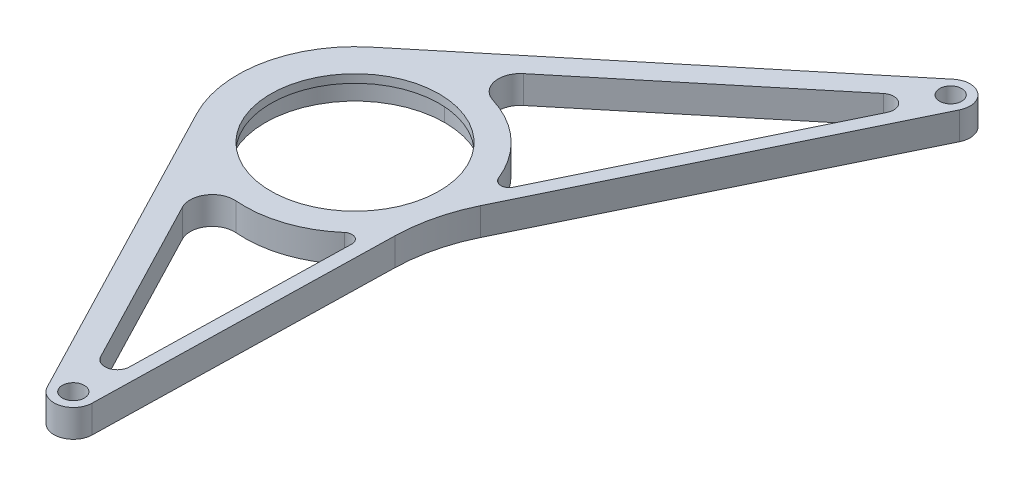
ISO-10303-21;
HEADER;
FILE_DESCRIPTION(('STEP AP214'),'2;1');
FILE_NAME('part.step','',(''),(''),'','','');
FILE_SCHEMA(('AUTOMOTIVE_DESIGN { 1 0 10303 214 1 1 1 1 }'));
ENDSEC;
DATA;
#1=APPLICATION_CONTEXT('core data for automotive mechanical design processes');
#2=APPLICATION_PROTOCOL_DEFINITION('international standard','automotive_design',2000,#1);
#3=PRODUCT_CONTEXT('',#1,'mechanical');
#4=PRODUCT('Part','Part','',(#3));
#5=PRODUCT_RELATED_PRODUCT_CATEGORY('part','',(#4));
#6=PRODUCT_DEFINITION_FORMATION('','',#4);
#7=PRODUCT_DEFINITION_CONTEXT('part definition',#1,'design');
#8=PRODUCT_DEFINITION('design','',#6,#7);
#9=PRODUCT_DEFINITION_SHAPE('','',#8);
#10=(LENGTH_UNIT() NAMED_UNIT(*) SI_UNIT(.MILLI.,.METRE.));
#11=(NAMED_UNIT(*) PLANE_ANGLE_UNIT() SI_UNIT($,.RADIAN.));
#12=(NAMED_UNIT(*) SI_UNIT($,.STERADIAN.) SOLID_ANGLE_UNIT());
#13=UNCERTAINTY_MEASURE_WITH_UNIT(LENGTH_MEASURE(1.E-05),#10,'distance_accuracy_value','');
#14=(GEOMETRIC_REPRESENTATION_CONTEXT(3) GLOBAL_UNCERTAINTY_ASSIGNED_CONTEXT((#13)) GLOBAL_UNIT_ASSIGNED_CONTEXT((#10,
#11,#12)) REPRESENTATION_CONTEXT('',''));
#15=CARTESIAN_POINT('',(0.,0.,0.));
#16=DIRECTION('',(0.,0.,1.));
#17=DIRECTION('',(1.,0.,0.));
#18=AXIS2_PLACEMENT_3D('',#15,#16,#17);
#19=CARTESIAN_POINT('',(1581.69995966024,10.,273.085544755227));
#20=DIRECTION('',(0.,-1.,0.));
#21=DIRECTION('',(0.,0.,-1.));
#22=AXIS2_PLACEMENT_3D('',#19,#20,#21);
#23=CYLINDRICAL_SURFACE('',#22,32.5);
#24=CARTESIAN_POINT('',(1581.69995966024,7.,273.085544755227));
#25=DIRECTION('',(0.,-1.,0.));
#26=DIRECTION('',(0.,0.,-1.));
#27=AXIS2_PLACEMENT_3D('',#24,#25,#26);
#28=CIRCLE('',#27,32.5);
#29=CARTESIAN_POINT('',(1581.69995966024,7.,305.585544755227));
#30=VERTEX_POINT('',#29);
#31=CARTESIAN_POINT('',(1581.69995966024,7.,240.585544755227));
#32=VERTEX_POINT('',#31);
#33=EDGE_CURVE('E325',#30,#32,#28,.T.);
#34=ORIENTED_EDGE('',*,*,#33,.F.);
#35=DIRECTION('',(0.,-1.,0.));
#36=VECTOR('',#35,1.);
#37=CARTESIAN_POINT('',(1581.69995966024,10.,305.585544755227));
#38=LINE('',#37,#36);
#39=CARTESIAN_POINT('',(1581.69995966024,0.,305.585544755227));
#40=VERTEX_POINT('',#39);
#41=EDGE_CURVE('E333',#30,#40,#38,.T.);
#42=ORIENTED_EDGE('',*,*,#41,.T.);
#43=CARTESIAN_POINT('',(1581.69995966024,0.,273.085544755227));
#44=DIRECTION('',(0.,1.,0.));
#45=DIRECTION('',(0.,0.,1.));
#46=AXIS2_PLACEMENT_3D('',#43,#44,#45);
#47=CIRCLE('',#46,32.5);
#48=CARTESIAN_POINT('',(1581.69995966024,0.,240.585544755227));
#49=VERTEX_POINT('',#48);
#50=EDGE_CURVE('E265',#49,#40,#47,.T.);
#51=ORIENTED_EDGE('',*,*,#50,.F.);
#52=DIRECTION('',(0.,1.,0.));
#53=VECTOR('',#52,1.);
#54=CARTESIAN_POINT('',(1581.69995966024,10.,240.585544755227));
#55=LINE('',#54,#53);
#56=EDGE_CURVE('E329',#49,#32,#55,.T.);
#57=ORIENTED_EDGE('',*,*,#56,.T.);
#58=EDGE_LOOP('',(#34,#42,#51,#57));
#59=FACE_BOUND('',#58,.T.);
#60=ADVANCED_FACE('F40',(#59),#23,.F.);
#61=CARTESIAN_POINT('',(1581.69995966024,10.,273.085544755227));
#62=DIRECTION('',(0.,1.,0.));
#63=DIRECTION('',(0.,0.,1.));
#64=AXIS2_PLACEMENT_3D('',#61,#62,#63);
#65=PLANE('',#64);
#66=CARTESIAN_POINT('',(1664.77260888871,10.,165.347828575399));
#67=DIRECTION('',(0.,1.,0.));
#68=DIRECTION('',(0.,0.,1.));
#69=AXIS2_PLACEMENT_3D('',#66,#67,#68);
#70=CIRCLE('',#69,4.31461254437187);
#71=CARTESIAN_POINT('',(1668.65408936428,10.,167.23197048243));
#72=VERTEX_POINT('',#71);
#73=CARTESIAN_POINT('',(1662.02549357169,10.,162.020782010798));
#74=VERTEX_POINT('',#73);
#75=EDGE_CURVE('E235',#72,#74,#70,.T.);
#76=ORIENTED_EDGE('',*,*,#75,.F.);
#77=DIRECTION('',(0.436688552599828,0.,-0.899612754482876));
#78=VECTOR('',#77,1.);
#79=CARTESIAN_POINT('',(1416.14411929432,10.,687.422363284387));
#80=LINE('',#79,#78);
#81=CARTESIAN_POINT('',(1624.35199953051,10.,258.49775894294));
#82=VERTEX_POINT('',#81);
#83=EDGE_CURVE('E208',#82,#72,#80,.T.);
#84=ORIENTED_EDGE('',*,*,#83,.F.);
#85=CARTESIAN_POINT('',(1621.65316126706,10.,257.18769328514));
#86=DIRECTION('',(0.,1.,0.));
#87=DIRECTION('',(0.,0.,1.));
#88=AXIS2_PLACEMENT_3D('',#85,#86,#87);
#89=CIRCLE('',#88,3.);
#90=CARTESIAN_POINT('',(1618.86572859682,10.,258.296845713286));
#91=VERTEX_POINT('',#90);
#92=EDGE_CURVE('E372',#82,#91,#89,.F.);
#93=ORIENTED_EDGE('',*,*,#92,.T.);
#94=CARTESIAN_POINT('',(1581.69995966024,10.,273.085544755227));
#95=DIRECTION('',(0.,1.,0.));
#96=DIRECTION('',(0.,0.,1.));
#97=AXIS2_PLACEMENT_3D('',#94,#95,#96);
#98=CIRCLE('',#97,39.9999999999999);
#99=CARTESIAN_POINT('',(1593.35725706454,10.,234.821888144444));
#100=VERTEX_POINT('',#99);
#101=EDGE_CURVE('E241',#91,#100,#98,.T.);
#102=ORIENTED_EDGE('',*,*,#101,.T.);
#103=CARTESIAN_POINT('',(1595.68871654539,10.,227.169156822288));
#104=DIRECTION('',(0.,1.,0.));
#105=DIRECTION('',(0.,0.,1.));
#106=AXIS2_PLACEMENT_3D('',#103,#104,#105);
#107=CIRCLE('',#106,8.);
#108=CARTESIAN_POINT('',(1590.59511374556,10.,221.000266280418));
#109=VERTEX_POINT('',#108);
#110=EDGE_CURVE('E359',#100,#109,#107,.F.);
#111=ORIENTED_EDGE('',*,*,#110,.T.);
#112=DIRECTION('',(-0.771111317733711,0.,0.636700349978685));
#113=VECTOR('',#112,1.);
#114=CARTESIAN_POINT('',(753.310918952788,10.,912.339023209776));
#115=LINE('',#114,#113);
#116=EDGE_CURVE('E237',#74,#109,#115,.T.);
#117=ORIENTED_EDGE('',*,*,#116,.F.);
#118=EDGE_LOOP('',(#76,#84,#93,#102,#111,#117));
#119=FACE_BOUND('',#118,.T.);
#120=CARTESIAN_POINT('',(1581.69995966024,10.,273.085544755227));
#121=DIRECTION('',(0.,1.,0.));
#122=DIRECTION('',(0.,0.,1.));
#123=AXIS2_PLACEMENT_3D('',#120,#121,#122);
#124=CIRCLE('',#123,42.5000000000001);
#125=CARTESIAN_POINT('',(1554.64019478615,10.,240.313313751544));
#126=VERTEX_POINT('',#125);
#127=CARTESIAN_POINT('',(1543.99345129198,10.,292.693431603988));
#128=VERTEX_POINT('',#127);
#129=EDGE_CURVE('E276',#126,#128,#124,.T.);
#130=ORIENTED_EDGE('',*,*,#129,.T.);
#131=DIRECTION('',(0.461362043500262,0.,0.887211961606279));
#132=VECTOR('',#131,1.);
#133=CARTESIAN_POINT('',(1543.99345129198,10.,292.693431603988));
#134=LINE('',#133,#132);
#135=CARTESIAN_POINT('',(1602.64951626876,10.,405.490665796321));
#136=VERTEX_POINT('',#135);
#137=EDGE_CURVE('E279',#128,#136,#134,.T.);
#138=ORIENTED_EDGE('',*,*,#137,.T.);
#139=CARTESIAN_POINT('',(1608.86,10.,402.261131491819));
#140=DIRECTION('',(0.,1.,0.));
#141=DIRECTION('',(0.,0.,1.));
#142=AXIS2_PLACEMENT_3D('',#139,#140,#141);
#143=CIRCLE('',#142,7.00000000000013);
#144=CARTESIAN_POINT('',(1615.85830019531,10.,402.415385750609));
#145=VERTEX_POINT('',#144);
#146=EDGE_CURVE('E282',#136,#145,#143,.T.);
#147=ORIENTED_EDGE('',*,*,#146,.T.);
#148=DIRECTION('',(0.0220363226841858,0.,-0.999757170758259));
#149=VECTOR('',#148,1.);
#150=CARTESIAN_POINT('',(1618.51297690742,10.,281.976412469369));
#151=LINE('',#150,#149);
#152=CARTESIAN_POINT('',(1618.22433138707,10.,295.071856428547));
#153=VERTEX_POINT('',#152);
#154=EDGE_CURVE('E284',#145,#153,#151,.T.);
#155=ORIENTED_EDGE('',*,*,#154,.T.);
#156=CARTESIAN_POINT('',(1678.20976163256,10.,296.394035789598));
#157=DIRECTION('',(0.,1.,0.));
#158=DIRECTION('',(0.,0.,1.));
#159=AXIS2_PLACEMENT_3D('',#156,#157,#158);
#160=CIRCLE('',#159,60.);
#161=CARTESIAN_POINT('',(1624.23299636359,10.,270.192722633608));
#162=VERTEX_POINT('',#161);
#163=EDGE_CURVE('E343',#153,#162,#160,.F.);
#164=ORIENTED_EDGE('',*,*,#163,.T.);
#165=DIRECTION('',(0.436688552599829,0.,-0.899612754482875));
#166=VECTOR('',#165,1.);
#167=CARTESIAN_POINT('',(1618.51297690742,10.,281.976412469369));
#168=LINE('',#167,#166);
#169=CARTESIAN_POINT('',(1680.94728928138,10.,153.356819868199));
#170=VERTEX_POINT('',#169);
#171=EDGE_CURVE('E287',#162,#170,#168,.T.);
#172=ORIENTED_EDGE('',*,*,#171,.T.);
#173=CARTESIAN_POINT('',(1674.65,10.,150.3));
#174=DIRECTION('',(0.,1.,0.));
#175=DIRECTION('',(0.,0.,1.));
#176=AXIS2_PLACEMENT_3D('',#173,#174,#175);
#177=CIRCLE('',#176,7.00000000000019);
#178=CARTESIAN_POINT('',(1670.19309755015,10.,144.902220775864));
#179=VERTEX_POINT('',#178);
#180=EDGE_CURVE('E289',#170,#179,#177,.T.);
#181=ORIENTED_EDGE('',*,*,#180,.T.);
#182=DIRECTION('',(-0.771111317733712,0.,0.636700349978684));
#183=VECTOR('',#182,1.);
#184=CARTESIAN_POINT('',(1670.19309755015,10.,144.902220775864));
#185=LINE('',#184,#183);
#186=EDGE_CURVE('E291',#179,#126,#185,.T.);
#187=ORIENTED_EDGE('',*,*,#186,.T.);
#188=EDGE_LOOP('',(#130,#138,#147,#155,#164,#172,#181,#187));
#189=FACE_BOUND('',#188,.T.);
#190=CARTESIAN_POINT('',(1608.86,10.,402.261131491819));
#191=DIRECTION('',(0.,1.,0.));
#192=DIRECTION('',(0.,0.,1.));
#193=AXIS2_PLACEMENT_3D('',#190,#191,#192);
#194=CIRCLE('',#193,3.99999999999999);
#195=CARTESIAN_POINT('',(1608.86,10.,406.261131491819));
#196=VERTEX_POINT('',#195);
#197=EDGE_CURVE('E270',#196,#196,#194,.T.);
#198=ORIENTED_EDGE('',*,*,#197,.F.);
#199=EDGE_LOOP('',(#198));
#200=FACE_BOUND('',#199,.T.);
#201=CARTESIAN_POINT('',(1674.65,10.,150.3));
#202=DIRECTION('',(0.,1.,0.));
#203=DIRECTION('',(0.,0.,1.));
#204=AXIS2_PLACEMENT_3D('',#201,#202,#203);
#205=CIRCLE('',#204,3.99999999999999);
#206=CARTESIAN_POINT('',(1674.65,10.,154.3));
#207=VERTEX_POINT('',#206);
#208=EDGE_CURVE('E259',#207,#207,#205,.T.);
#209=ORIENTED_EDGE('',*,*,#208,.F.);
#210=EDGE_LOOP('',(#209));
#211=FACE_BOUND('',#210,.T.);
#212=DIRECTION('',(0.0220363226841804,0.,-0.999757170758259));
#213=VECTOR('',#212,1.);
#214=CARTESIAN_POINT('',(1618.94045627387,10.,35.6841594583088));
#215=LINE('',#214,#213);
#216=CARTESIAN_POINT('',(1611.25506616698,10.,384.359570485813));
#217=VERTEX_POINT('',#216);
#218=CARTESIAN_POINT('',(1612.99255756892,10.,305.53201322448));
#219=VERTEX_POINT('',#218);
#220=EDGE_CURVE('E247',#217,#219,#215,.T.);
#221=ORIENTED_EDGE('',*,*,#220,.F.);
#222=CARTESIAN_POINT('',(1606.78902654969,10.,384.261131491819));
#223=DIRECTION('',(0.,1.,0.));
#224=DIRECTION('',(0.,0.,1.));
#225=AXIS2_PLACEMENT_3D('',#222,#223,#224);
#226=CIRCLE('',#225,4.46712436571735);
#227=CARTESIAN_POINT('',(1602.82574037844,10.,386.322093117757));
#228=VERTEX_POINT('',#227);
#229=EDGE_CURVE('E219',#217,#228,#226,.F.);
#230=ORIENTED_EDGE('',*,*,#229,.T.);
#231=DIRECTION('',(-0.461362043500263,0.,-0.887211961606279));
#232=VECTOR('',#231,1.);
#233=CARTESIAN_POINT('',(1103.52472371897,10.,-573.847562499367));
#234=LINE('',#233,#232);
#235=CARTESIAN_POINT('',(1570.74025781245,10.,324.620823306986));
#236=VERTEX_POINT('',#235);
#237=EDGE_CURVE('E251',#228,#236,#234,.T.);
#238=ORIENTED_EDGE('',*,*,#237,.T.);
#239=CARTESIAN_POINT('',(1577.8379535053,10.,320.929926958984));
#240=DIRECTION('',(0.,1.,0.));
#241=DIRECTION('',(0.,0.,1.));
#242=AXIS2_PLACEMENT_3D('',#239,#240,#241);
#243=CIRCLE('',#242,8.);
#244=CARTESIAN_POINT('',(1578.48162119779,10.,312.955863258358));
#245=VERTEX_POINT('',#244);
#246=EDGE_CURVE('E355',#236,#245,#243,.F.);
#247=ORIENTED_EDGE('',*,*,#246,.T.);
#248=CARTESIAN_POINT('',(1581.69995966024,10.,273.085544755227));
#249=DIRECTION('',(0.,1.,0.));
#250=DIRECTION('',(0.,0.,1.));
#251=AXIS2_PLACEMENT_3D('',#248,#249,#250);
#252=CIRCLE('',#251,39.9999999999999);
#253=CARTESIAN_POINT('',(1608.01933305224,10.,303.206809407506));
#254=VERTEX_POINT('',#253);
#255=EDGE_CURVE('E249',#245,#254,#252,.T.);
#256=ORIENTED_EDGE('',*,*,#255,.T.);
#257=CARTESIAN_POINT('',(1609.99328605664,10.,305.465904256427));
#258=DIRECTION('',(0.,1.,0.));
#259=DIRECTION('',(0.,0.,1.));
#260=AXIS2_PLACEMENT_3D('',#257,#258,#259);
#261=CIRCLE('',#260,3.);
#262=EDGE_CURVE('E48',#254,#219,#261,.F.);
#263=ORIENTED_EDGE('',*,*,#262,.T.);
#264=EDGE_LOOP('',(#221,#230,#238,#247,#256,#263));
#265=FACE_BOUND('',#264,.T.);
#266=CARTESIAN_POINT('',(1581.69995966024,10.,273.085544755227));
#267=DIRECTION('',(0.,-1.,0.));
#268=DIRECTION('',(0.,0.,-1.));
#269=AXIS2_PLACEMENT_3D('',#266,#267,#268);
#270=CIRCLE('',#269,30.5000000000001);
#271=CARTESIAN_POINT('',(1581.69995966024,10.,242.585544755227));
#272=VERTEX_POINT('',#271);
#273=EDGE_CURVE('E432',#272,#272,#270,.T.);
#274=ORIENTED_EDGE('',*,*,#273,.T.);
#275=EDGE_LOOP('',(#274));
#276=FACE_BOUND('',#275,.T.);
#277=ADVANCED_FACE('F376',(#119,#189,#200,#211,#265,#276),#65,.T.);
#278=CARTESIAN_POINT('',(1581.69995966024,0.,273.085544755227));
#279=DIRECTION('',(0.,1.,0.));
#280=DIRECTION('',(0.,0.,1.));
#281=AXIS2_PLACEMENT_3D('',#278,#279,#280);
#282=PLANE('',#281);
#283=DIRECTION('',(-0.771111317733711,0.,0.636700349978685));
#284=VECTOR('',#283,1.);
#285=CARTESIAN_POINT('',(753.310918952788,0.,912.339023209776));
#286=LINE('',#285,#284);
#287=CARTESIAN_POINT('',(1662.02549357169,0.,162.020782010798));
#288=VERTEX_POINT('',#287);
#289=CARTESIAN_POINT('',(1590.59511374556,0.,221.000266280418));
#290=VERTEX_POINT('',#289);
#291=EDGE_CURVE('E217',#288,#290,#286,.T.);
#292=ORIENTED_EDGE('',*,*,#291,.T.);
#293=CARTESIAN_POINT('',(1595.68871654539,0.,227.169156822288));
#294=DIRECTION('',(0.,1.,0.));
#295=DIRECTION('',(0.,0.,1.));
#296=AXIS2_PLACEMENT_3D('',#293,#294,#295);
#297=CIRCLE('',#296,8.);
#298=CARTESIAN_POINT('',(1593.35725706454,0.,234.821888144444));
#299=VERTEX_POINT('',#298);
#300=EDGE_CURVE('E361',#290,#299,#297,.T.);
#301=ORIENTED_EDGE('',*,*,#300,.T.);
#302=CARTESIAN_POINT('',(1581.69995966024,0.,273.085544755227));
#303=DIRECTION('',(0.,1.,0.));
#304=DIRECTION('',(0.,0.,1.));
#305=AXIS2_PLACEMENT_3D('',#302,#303,#304);
#306=CIRCLE('',#305,39.9999999999999);
#307=CARTESIAN_POINT('',(1618.86572859682,0.,258.296845713286));
#308=VERTEX_POINT('',#307);
#309=EDGE_CURVE('E202',#308,#299,#306,.T.);
#310=ORIENTED_EDGE('',*,*,#309,.F.);
#311=CARTESIAN_POINT('',(1621.65316126706,0.,257.18769328514));
#312=DIRECTION('',(0.,1.,0.));
#313=DIRECTION('',(0.,0.,1.));
#314=AXIS2_PLACEMENT_3D('',#311,#312,#313);
#315=CIRCLE('',#314,3.);
#316=CARTESIAN_POINT('',(1624.35199953051,0.,258.49775894294));
#317=VERTEX_POINT('',#316);
#318=EDGE_CURVE('E198',#308,#317,#315,.T.);
#319=ORIENTED_EDGE('',*,*,#318,.T.);
#320=DIRECTION('',(0.436688552599828,0.,-0.899612754482876));
#321=VECTOR('',#320,1.);
#322=CARTESIAN_POINT('',(1416.14411929432,0.,687.422363284387));
#323=LINE('',#322,#321);
#324=CARTESIAN_POINT('',(1668.65408936428,0.,167.23197048243));
#325=VERTEX_POINT('',#324);
#326=EDGE_CURVE('E189',#317,#325,#323,.T.);
#327=ORIENTED_EDGE('',*,*,#326,.T.);
#328=CARTESIAN_POINT('',(1664.77260888871,0.,165.347828575399));
#329=DIRECTION('',(0.,1.,0.));
#330=DIRECTION('',(0.,0.,1.));
#331=AXIS2_PLACEMENT_3D('',#328,#329,#330);
#332=CIRCLE('',#331,4.31461254437187);
#333=EDGE_CURVE('E195',#325,#288,#332,.T.);
#334=ORIENTED_EDGE('',*,*,#333,.T.);
#335=EDGE_LOOP('',(#292,#301,#310,#319,#327,#334));
#336=FACE_BOUND('',#335,.T.);
#337=DIRECTION('',(-0.461362043500263,0.,-0.887211961606279));
#338=VECTOR('',#337,1.);
#339=CARTESIAN_POINT('',(1103.52472371897,0.,-573.847562499367));
#340=LINE('',#339,#338);
#341=CARTESIAN_POINT('',(1602.82574037844,0.,386.322093117757));
#342=VERTEX_POINT('',#341);
#343=CARTESIAN_POINT('',(1570.74025781245,0.,324.620823306986));
#344=VERTEX_POINT('',#343);
#345=EDGE_CURVE('E232',#342,#344,#340,.T.);
#346=ORIENTED_EDGE('',*,*,#345,.F.);
#347=CARTESIAN_POINT('',(1606.78902654969,0.,384.261131491819));
#348=DIRECTION('',(0.,1.,0.));
#349=DIRECTION('',(0.,0.,1.));
#350=AXIS2_PLACEMENT_3D('',#347,#348,#349);
#351=CIRCLE('',#350,4.46712436571735);
#352=CARTESIAN_POINT('',(1611.25506616698,0.,384.359570485813));
#353=VERTEX_POINT('',#352);
#354=EDGE_CURVE('E223',#353,#342,#351,.F.);
#355=ORIENTED_EDGE('',*,*,#354,.F.);
#356=DIRECTION('',(0.0220363226841804,0.,-0.999757170758259));
#357=VECTOR('',#356,1.);
#358=CARTESIAN_POINT('',(1618.94045627387,0.,35.6841594583088));
#359=LINE('',#358,#357);
#360=CARTESIAN_POINT('',(1612.99255756892,0.,305.53201322448));
#361=VERTEX_POINT('',#360);
#362=EDGE_CURVE('E226',#353,#361,#359,.T.);
#363=ORIENTED_EDGE('',*,*,#362,.T.);
#364=CARTESIAN_POINT('',(1609.99328605664,0.,305.465904256427));
#365=DIRECTION('',(0.,1.,0.));
#366=DIRECTION('',(0.,0.,1.));
#367=AXIS2_PLACEMENT_3D('',#364,#365,#366);
#368=CIRCLE('',#367,3.);
#369=CARTESIAN_POINT('',(1608.01933305224,0.,303.206809407506));
#370=VERTEX_POINT('',#369);
#371=EDGE_CURVE('E11',#361,#370,#368,.T.);
#372=ORIENTED_EDGE('',*,*,#371,.T.);
#373=CARTESIAN_POINT('',(1581.69995966024,0.,273.085544755227));
#374=DIRECTION('',(0.,1.,0.));
#375=DIRECTION('',(0.,0.,1.));
#376=AXIS2_PLACEMENT_3D('',#373,#374,#375);
#377=CIRCLE('',#376,39.9999999999999);
#378=CARTESIAN_POINT('',(1578.48162119779,0.,312.955863258358));
#379=VERTEX_POINT('',#378);
#380=EDGE_CURVE('E229',#379,#370,#377,.T.);
#381=ORIENTED_EDGE('',*,*,#380,.F.);
#382=CARTESIAN_POINT('',(1577.8379535053,0.,320.929926958984));
#383=DIRECTION('',(0.,1.,0.));
#384=DIRECTION('',(0.,0.,1.));
#385=AXIS2_PLACEMENT_3D('',#382,#383,#384);
#386=CIRCLE('',#385,8.);
#387=EDGE_CURVE('E357',#379,#344,#386,.T.);
#388=ORIENTED_EDGE('',*,*,#387,.T.);
#389=EDGE_LOOP('',(#346,#355,#363,#372,#381,#388));
#390=FACE_BOUND('',#389,.T.);
#391=CARTESIAN_POINT('',(1581.69995966024,0.,273.085544755227));
#392=DIRECTION('',(0.,1.,0.));
#393=DIRECTION('',(0.,0.,1.));
#394=AXIS2_PLACEMENT_3D('',#391,#392,#393);
#395=CIRCLE('',#394,42.5000000000001);
#396=CARTESIAN_POINT('',(1554.64019478615,0.,240.313313751544));
#397=VERTEX_POINT('',#396);
#398=CARTESIAN_POINT('',(1543.99345129198,0.,292.693431603988));
#399=VERTEX_POINT('',#398);
#400=EDGE_CURVE('E273',#397,#399,#395,.T.);
#401=ORIENTED_EDGE('',*,*,#400,.F.);
#402=DIRECTION('',(-0.771111317733712,0.,0.636700349978684));
#403=VECTOR('',#402,1.);
#404=CARTESIAN_POINT('',(1670.19309755015,0.,144.902220775864));
#405=LINE('',#404,#403);
#406=CARTESIAN_POINT('',(1670.19309755015,0.,144.902220775864));
#407=VERTEX_POINT('',#406);
#408=EDGE_CURVE('E280',#407,#397,#405,.T.);
#409=ORIENTED_EDGE('',*,*,#408,.F.);
#410=CARTESIAN_POINT('',(1674.65,0.,150.3));
#411=DIRECTION('',(0.,1.,0.));
#412=DIRECTION('',(0.,0.,1.));
#413=AXIS2_PLACEMENT_3D('',#410,#411,#412);
#414=CIRCLE('',#413,7.00000000000019);
#415=CARTESIAN_POINT('',(1680.94728928138,0.,153.356819868199));
#416=VERTEX_POINT('',#415);
#417=EDGE_CURVE('E305',#416,#407,#414,.T.);
#418=ORIENTED_EDGE('',*,*,#417,.F.);
#419=DIRECTION('',(0.436688552599829,0.,-0.899612754482875));
#420=VECTOR('',#419,1.);
#421=CARTESIAN_POINT('',(1618.51297690742,0.,281.976412469369));
#422=LINE('',#421,#420);
#423=CARTESIAN_POINT('',(1624.23299636359,0.,270.192722633608));
#424=VERTEX_POINT('',#423);
#425=EDGE_CURVE('E303',#424,#416,#422,.T.);
#426=ORIENTED_EDGE('',*,*,#425,.F.);
#427=CARTESIAN_POINT('',(1678.20976163256,0.,296.394035789598));
#428=DIRECTION('',(0.,1.,0.));
#429=DIRECTION('',(0.,0.,1.));
#430=AXIS2_PLACEMENT_3D('',#427,#428,#429);
#431=CIRCLE('',#430,60.);
#432=CARTESIAN_POINT('',(1618.22433138707,0.,295.071856428547));
#433=VERTEX_POINT('',#432);
#434=EDGE_CURVE('E341',#424,#433,#431,.T.);
#435=ORIENTED_EDGE('',*,*,#434,.T.);
#436=DIRECTION('',(0.0220363226841858,0.,-0.999757170758259));
#437=VECTOR('',#436,1.);
#438=CARTESIAN_POINT('',(1618.51297690742,0.,281.976412469369));
#439=LINE('',#438,#437);
#440=CARTESIAN_POINT('',(1615.85830019531,0.,402.415385750609));
#441=VERTEX_POINT('',#440);
#442=EDGE_CURVE('E300',#441,#433,#439,.T.);
#443=ORIENTED_EDGE('',*,*,#442,.F.);
#444=CARTESIAN_POINT('',(1608.86,0.,402.261131491819));
#445=DIRECTION('',(0.,1.,0.));
#446=DIRECTION('',(0.,0.,1.));
#447=AXIS2_PLACEMENT_3D('',#444,#445,#446);
#448=CIRCLE('',#447,7.00000000000013);
#449=CARTESIAN_POINT('',(1602.64951626876,0.,405.490665796321));
#450=VERTEX_POINT('',#449);
#451=EDGE_CURVE('E298',#450,#441,#448,.T.);
#452=ORIENTED_EDGE('',*,*,#451,.F.);
#453=DIRECTION('',(0.461362043500262,0.,0.887211961606279));
#454=VECTOR('',#453,1.);
#455=CARTESIAN_POINT('',(1543.99345129198,0.,292.693431603988));
#456=LINE('',#455,#454);
#457=EDGE_CURVE('E296',#399,#450,#456,.T.);
#458=ORIENTED_EDGE('',*,*,#457,.F.);
#459=EDGE_LOOP('',(#401,#409,#418,#426,#435,#443,#452,#458));
#460=FACE_BOUND('',#459,.T.);
#461=CARTESIAN_POINT('',(1608.86,0.,402.261131491819));
#462=DIRECTION('',(0.,1.,0.));
#463=DIRECTION('',(0.,0.,1.));
#464=AXIS2_PLACEMENT_3D('',#461,#462,#463);
#465=CIRCLE('',#464,3.99999999999999);
#466=CARTESIAN_POINT('',(1608.86,0.,406.261131491819));
#467=VERTEX_POINT('',#466);
#468=EDGE_CURVE('E269',#467,#467,#465,.T.);
#469=ORIENTED_EDGE('',*,*,#468,.T.);
#470=EDGE_LOOP('',(#469));
#471=FACE_BOUND('',#470,.T.);
#472=ORIENTED_EDGE('',*,*,#50,.T.);
#473=EDGE_CURVE('E262',#40,#49,#47,.T.);
#474=ORIENTED_EDGE('',*,*,#473,.T.);
#475=EDGE_LOOP('',(#472,#474));
#476=FACE_BOUND('',#475,.T.);
#477=CARTESIAN_POINT('',(1674.65,0.,150.3));
#478=DIRECTION('',(0.,1.,0.));
#479=DIRECTION('',(0.,0.,1.));
#480=AXIS2_PLACEMENT_3D('',#477,#478,#479);
#481=CIRCLE('',#480,3.99999999999999);
#482=CARTESIAN_POINT('',(1674.65,0.,154.3));
#483=VERTEX_POINT('',#482);
#484=EDGE_CURVE('E211',#483,#483,#481,.T.);
#485=ORIENTED_EDGE('',*,*,#484,.T.);
#486=EDGE_LOOP('',(#485));
#487=FACE_BOUND('',#486,.T.);
#488=ADVANCED_FACE('F192',(#336,#390,#460,#471,#476,#487),#282,.F.);
#489=CARTESIAN_POINT('',(1581.69995966024,10.,273.085544755227));
#490=DIRECTION('',(0.,-1.,0.));
#491=DIRECTION('',(0.,0.,-1.));
#492=AXIS2_PLACEMENT_3D('',#489,#490,#491);
#493=CYLINDRICAL_SURFACE('',#492,42.5000000000001);
#494=ORIENTED_EDGE('',*,*,#400,.T.);
#495=DIRECTION('',(0.,-1.,0.));
#496=VECTOR('',#495,1.);
#497=CARTESIAN_POINT('',(1543.99345129198,10.,292.693431603988));
#498=LINE('',#497,#496);
#499=EDGE_CURVE('E322',#128,#399,#498,.T.);
#500=ORIENTED_EDGE('',*,*,#499,.F.);
#501=ORIENTED_EDGE('',*,*,#129,.F.);
#502=DIRECTION('',(0.,-1.,0.));
#503=VECTOR('',#502,1.);
#504=CARTESIAN_POINT('',(1554.64019478615,10.,240.313313751544));
#505=LINE('',#504,#503);
#506=EDGE_CURVE('E293',#126,#397,#505,.T.);
#507=ORIENTED_EDGE('',*,*,#506,.T.);
#508=EDGE_LOOP('',(#494,#500,#501,#507));
#509=FACE_BOUND('',#508,.T.);
#510=ADVANCED_FACE('F535',(#509),#493,.T.);
#511=CARTESIAN_POINT('',(1543.99345129198,10.,292.693431603988));
#512=DIRECTION('',(0.887211961606279,0.,-0.461362043500262));
#513=DIRECTION('',(-0.461362043500262,0.,-0.88721196160628));
#514=AXIS2_PLACEMENT_3D('',#511,#512,#513);
#515=PLANE('',#514);
#516=ORIENTED_EDGE('',*,*,#457,.T.);
#517=DIRECTION('',(0.,-1.,0.));
#518=VECTOR('',#517,1.);
#519=CARTESIAN_POINT('',(1602.64951626876,10.,405.490665796321));
#520=LINE('',#519,#518);
#521=EDGE_CURVE('E319',#136,#450,#520,.T.);
#522=ORIENTED_EDGE('',*,*,#521,.F.);
#523=ORIENTED_EDGE('',*,*,#137,.F.);
#524=ORIENTED_EDGE('',*,*,#499,.T.);
#525=EDGE_LOOP('',(#516,#522,#523,#524));
#526=FACE_BOUND('',#525,.T.);
#527=ADVANCED_FACE('F652',(#526),#515,.F.);
#528=CARTESIAN_POINT('',(1608.86,10.,402.261131491819));
#529=DIRECTION('',(0.,-1.,0.));
#530=DIRECTION('',(0.,0.,-1.));
#531=AXIS2_PLACEMENT_3D('',#528,#529,#530);
#532=CYLINDRICAL_SURFACE('',#531,7.00000000000013);
#533=ORIENTED_EDGE('',*,*,#451,.T.);
#534=DIRECTION('',(0.,-1.,0.));
#535=VECTOR('',#534,1.);
#536=CARTESIAN_POINT('',(1615.85830019531,10.,402.415385750609));
#537=LINE('',#536,#535);
#538=EDGE_CURVE('E316',#145,#441,#537,.T.);
#539=ORIENTED_EDGE('',*,*,#538,.F.);
#540=ORIENTED_EDGE('',*,*,#146,.F.);
#541=ORIENTED_EDGE('',*,*,#521,.T.);
#542=EDGE_LOOP('',(#533,#539,#540,#541));
#543=FACE_BOUND('',#542,.T.);
#544=ADVANCED_FACE('F620',(#543),#532,.T.);
#545=CARTESIAN_POINT('',(1618.51297690742,10.,281.976412469369));
#546=DIRECTION('',(-0.999757170758259,0.,-0.0220363226841858));
#547=DIRECTION('',(-0.0220363226841858,0.,0.999757170758259));
#548=AXIS2_PLACEMENT_3D('',#545,#546,#547);
#549=PLANE('',#548);
#550=ORIENTED_EDGE('',*,*,#442,.T.);
#551=DIRECTION('',(0.,-1.,0.));
#552=VECTOR('',#551,1.);
#553=CARTESIAN_POINT('',(1618.22433138707,10.,295.071856428547));
#554=LINE('',#553,#552);
#555=EDGE_CURVE('E339',#433,#153,#554,.F.);
#556=ORIENTED_EDGE('',*,*,#555,.T.);
#557=ORIENTED_EDGE('',*,*,#154,.F.);
#558=ORIENTED_EDGE('',*,*,#538,.T.);
#559=EDGE_LOOP('',(#550,#556,#557,#558));
#560=FACE_BOUND('',#559,.T.);
#561=ADVANCED_FACE('F608',(#560),#549,.F.);
#562=CARTESIAN_POINT('',(1618.51297690742,10.,281.976412469369));
#563=DIRECTION('',(-0.899612754482875,0.,-0.436688552599829));
#564=DIRECTION('',(-0.436688552599829,0.,0.899612754482875));
#565=AXIS2_PLACEMENT_3D('',#562,#563,#564);
#566=PLANE('',#565);
#567=ORIENTED_EDGE('',*,*,#171,.F.);
#568=DIRECTION('',(0.,-1.,0.));
#569=VECTOR('',#568,1.);
#570=CARTESIAN_POINT('',(1624.23299636359,0.,270.192722633608));
#571=LINE('',#570,#569);
#572=EDGE_CURVE('E336',#162,#424,#571,.T.);
#573=ORIENTED_EDGE('',*,*,#572,.T.);
#574=ORIENTED_EDGE('',*,*,#425,.T.);
#575=DIRECTION('',(0.,-1.,0.));
#576=VECTOR('',#575,1.);
#577=CARTESIAN_POINT('',(1680.94728928138,10.,153.356819868199));
#578=LINE('',#577,#576);
#579=EDGE_CURVE('E313',#170,#416,#578,.T.);
#580=ORIENTED_EDGE('',*,*,#579,.F.);
#581=EDGE_LOOP('',(#567,#573,#574,#580));
#582=FACE_BOUND('',#581,.T.);
#583=ADVANCED_FACE('F602',(#582),#566,.F.);
#584=CARTESIAN_POINT('',(1674.65,10.,150.3));
#585=DIRECTION('',(0.,-1.,0.));
#586=DIRECTION('',(0.,0.,-1.));
#587=AXIS2_PLACEMENT_3D('',#584,#585,#586);
#588=CYLINDRICAL_SURFACE('',#587,7.00000000000019);
#589=ORIENTED_EDGE('',*,*,#417,.T.);
#590=DIRECTION('',(0.,-1.,0.));
#591=VECTOR('',#590,1.);
#592=CARTESIAN_POINT('',(1670.19309755015,10.,144.902220775864));
#593=LINE('',#592,#591);
#594=EDGE_CURVE('E310',#179,#407,#593,.T.);
#595=ORIENTED_EDGE('',*,*,#594,.F.);
#596=ORIENTED_EDGE('',*,*,#180,.F.);
#597=ORIENTED_EDGE('',*,*,#579,.T.);
#598=EDGE_LOOP('',(#589,#595,#596,#597));
#599=FACE_BOUND('',#598,.T.);
#600=ADVANCED_FACE('F607',(#599),#588,.T.);
#601=CARTESIAN_POINT('',(1670.19309755015,10.,144.902220775864));
#602=DIRECTION('',(0.636700349978684,0.,0.771111317733712));
#603=DIRECTION('',(0.771111317733712,0.,-0.636700349978684));
#604=AXIS2_PLACEMENT_3D('',#601,#602,#603);
#605=PLANE('',#604);
#606=ORIENTED_EDGE('',*,*,#408,.T.);
#607=ORIENTED_EDGE('',*,*,#506,.F.);
#608=ORIENTED_EDGE('',*,*,#186,.F.);
#609=ORIENTED_EDGE('',*,*,#594,.T.);
#610=EDGE_LOOP('',(#606,#607,#608,#609));
#611=FACE_BOUND('',#610,.T.);
#612=ADVANCED_FACE('F416',(#611),#605,.F.);
#613=CARTESIAN_POINT('',(1608.86,10.,402.261131491819));
#614=DIRECTION('',(0.,-1.,0.));
#615=DIRECTION('',(0.,0.,-1.));
#616=AXIS2_PLACEMENT_3D('',#613,#614,#615);
#617=CYLINDRICAL_SURFACE('',#616,3.99999999999999);
#618=ORIENTED_EDGE('',*,*,#197,.T.);
#619=EDGE_LOOP('',(#618));
#620=FACE_BOUND('',#619,.T.);
#621=ORIENTED_EDGE('',*,*,#468,.F.);
#622=EDGE_LOOP('',(#621));
#623=FACE_BOUND('',#622,.T.);
#624=ADVANCED_FACE('F408',(#620,#623),#617,.F.);
#625=ORIENTED_EDGE('',*,*,#41,.F.);
#626=EDGE_CURVE('E326',#32,#30,#28,.T.);
#627=ORIENTED_EDGE('',*,*,#626,.F.);
#628=ORIENTED_EDGE('',*,*,#56,.F.);
#629=ORIENTED_EDGE('',*,*,#473,.F.);
#630=EDGE_LOOP('',(#625,#627,#628,#629));
#631=FACE_BOUND('',#630,.T.);
#632=ADVANCED_FACE('F398',(#631),#23,.F.);
#633=CARTESIAN_POINT('',(1674.65,10.,150.3));
#634=DIRECTION('',(0.,-1.,0.));
#635=DIRECTION('',(0.,0.,-1.));
#636=AXIS2_PLACEMENT_3D('',#633,#634,#635);
#637=CYLINDRICAL_SURFACE('',#636,3.99999999999999);
#638=ORIENTED_EDGE('',*,*,#208,.T.);
#639=EDGE_LOOP('',(#638));
#640=FACE_BOUND('',#639,.T.);
#641=ORIENTED_EDGE('',*,*,#484,.F.);
#642=EDGE_LOOP('',(#641));
#643=FACE_BOUND('',#642,.T.);
#644=ADVANCED_FACE('F407',(#640,#643),#637,.F.);
#645=CARTESIAN_POINT('',(1606.78902654969,6.,384.261131491819));
#646=DIRECTION('',(0.,1.,0.));
#647=DIRECTION('',(0.,0.,1.));
#648=AXIS2_PLACEMENT_3D('',#645,#646,#647);
#649=CYLINDRICAL_SURFACE('',#648,4.46712436571735);
#650=ORIENTED_EDGE('',*,*,#229,.F.);
#651=DIRECTION('',(0.,1.,0.));
#652=VECTOR('',#651,1.);
#653=CARTESIAN_POINT('',(1611.25506616698,6.,384.359570485813));
#654=LINE('',#653,#652);
#655=EDGE_CURVE('E254',#353,#217,#654,.T.);
#656=ORIENTED_EDGE('',*,*,#655,.F.);
#657=ORIENTED_EDGE('',*,*,#354,.T.);
#658=DIRECTION('',(0.,1.,0.));
#659=VECTOR('',#658,1.);
#660=CARTESIAN_POINT('',(1602.82574037844,6.,386.322093117757));
#661=LINE('',#660,#659);
#662=EDGE_CURVE('E238',#342,#228,#661,.T.);
#663=ORIENTED_EDGE('',*,*,#662,.T.);
#664=EDGE_LOOP('',(#650,#656,#657,#663));
#665=FACE_BOUND('',#664,.T.);
#666=ADVANCED_FACE('F414',(#665),#649,.F.);
#667=CARTESIAN_POINT('',(1103.52472371897,6.,-573.847562499367));
#668=DIRECTION('',(0.887211961606279,0.,-0.461362043500263));
#669=DIRECTION('',(-0.461362043500263,0.,-0.887211961606279));
#670=AXIS2_PLACEMENT_3D('',#667,#668,#669);
#671=PLANE('',#670);
#672=ORIENTED_EDGE('',*,*,#345,.T.);
#673=DIRECTION('',(0.,-1.,0.));
#674=VECTOR('',#673,1.);
#675=CARTESIAN_POINT('',(1570.74025781245,10.,324.620823306986));
#676=LINE('',#675,#674);
#677=EDGE_CURVE('E345',#344,#236,#676,.F.);
#678=ORIENTED_EDGE('',*,*,#677,.T.);
#679=ORIENTED_EDGE('',*,*,#237,.F.);
#680=ORIENTED_EDGE('',*,*,#662,.F.);
#681=EDGE_LOOP('',(#672,#678,#679,#680));
#682=FACE_BOUND('',#681,.T.);
#683=ADVANCED_FACE('F451',(#682),#671,.T.);
#684=CARTESIAN_POINT('',(1581.69995966024,6.,273.085544755227));
#685=DIRECTION('',(0.,1.,0.));
#686=DIRECTION('',(0.,0.,1.));
#687=AXIS2_PLACEMENT_3D('',#684,#685,#686);
#688=CYLINDRICAL_SURFACE('',#687,39.9999999999999);
#689=ORIENTED_EDGE('',*,*,#380,.T.);
#690=DIRECTION('',(0.,1.,0.));
#691=VECTOR('',#690,1.);
#692=CARTESIAN_POINT('',(1608.01933305224,6.,303.206809407506));
#693=LINE('',#692,#691);
#694=EDGE_CURVE('E368',#370,#254,#693,.T.);
#695=ORIENTED_EDGE('',*,*,#694,.T.);
#696=ORIENTED_EDGE('',*,*,#255,.F.);
#697=DIRECTION('',(0.,1.,0.));
#698=VECTOR('',#697,1.);
#699=CARTESIAN_POINT('',(1578.48162119779,6.,312.955863258358));
#700=LINE('',#699,#698);
#701=EDGE_CURVE('E348',#245,#379,#700,.F.);
#702=ORIENTED_EDGE('',*,*,#701,.T.);
#703=EDGE_LOOP('',(#689,#695,#696,#702));
#704=FACE_BOUND('',#703,.T.);
#705=ADVANCED_FACE('F454',(#704),#688,.T.);
#706=CARTESIAN_POINT('',(1618.94045627387,6.,35.6841594583088));
#707=DIRECTION('',(0.999757170758259,0.,0.0220363226841804));
#708=DIRECTION('',(0.0220363226841804,0.,-0.999757170758259));
#709=AXIS2_PLACEMENT_3D('',#706,#707,#708);
#710=PLANE('',#709);
#711=ORIENTED_EDGE('',*,*,#220,.T.);
#712=DIRECTION('',(0.,1.,0.));
#713=VECTOR('',#712,1.);
#714=CARTESIAN_POINT('',(1612.99255756892,6.,305.53201322448));
#715=LINE('',#714,#713);
#716=EDGE_CURVE('E55',#219,#361,#715,.F.);
#717=ORIENTED_EDGE('',*,*,#716,.T.);
#718=ORIENTED_EDGE('',*,*,#362,.F.);
#719=ORIENTED_EDGE('',*,*,#655,.T.);
#720=EDGE_LOOP('',(#711,#717,#718,#719));
#721=FACE_BOUND('',#720,.T.);
#722=ADVANCED_FACE('F450',(#721),#710,.F.);
#723=CARTESIAN_POINT('',(1664.77260888871,6.,165.347828575399));
#724=DIRECTION('',(0.,1.,0.));
#725=DIRECTION('',(0.,0.,1.));
#726=AXIS2_PLACEMENT_3D('',#723,#724,#725);
#727=CYLINDRICAL_SURFACE('',#726,4.31461254437187);
#728=ORIENTED_EDGE('',*,*,#75,.T.);
#729=DIRECTION('',(0.,1.,0.));
#730=VECTOR('',#729,1.);
#731=CARTESIAN_POINT('',(1662.02549357169,6.,162.020782010798));
#732=LINE('',#731,#730);
#733=EDGE_CURVE('E212',#288,#74,#732,.T.);
#734=ORIENTED_EDGE('',*,*,#733,.F.);
#735=ORIENTED_EDGE('',*,*,#333,.F.);
#736=DIRECTION('',(0.,1.,0.));
#737=VECTOR('',#736,1.);
#738=CARTESIAN_POINT('',(1668.65408936428,6.,167.23197048243));
#739=LINE('',#738,#737);
#740=EDGE_CURVE('E205',#325,#72,#739,.T.);
#741=ORIENTED_EDGE('',*,*,#740,.T.);
#742=EDGE_LOOP('',(#728,#734,#735,#741));
#743=FACE_BOUND('',#742,.T.);
#744=ADVANCED_FACE('F214',(#743),#727,.F.);
#745=CARTESIAN_POINT('',(1416.14411929432,6.,687.422363284387));
#746=DIRECTION('',(0.899612754482876,0.,0.436688552599828));
#747=DIRECTION('',(0.436688552599828,0.,-0.899612754482876));
#748=AXIS2_PLACEMENT_3D('',#745,#746,#747);
#749=PLANE('',#748);
#750=ORIENTED_EDGE('',*,*,#326,.F.);
#751=DIRECTION('',(0.,1.,0.));
#752=VECTOR('',#751,1.);
#753=CARTESIAN_POINT('',(1624.35199953051,6.,258.49775894294));
#754=LINE('',#753,#752);
#755=EDGE_CURVE('E364',#317,#82,#754,.T.);
#756=ORIENTED_EDGE('',*,*,#755,.T.);
#757=ORIENTED_EDGE('',*,*,#83,.T.);
#758=ORIENTED_EDGE('',*,*,#740,.F.);
#759=EDGE_LOOP('',(#750,#756,#757,#758));
#760=FACE_BOUND('',#759,.T.);
#761=ADVANCED_FACE('F206',(#760),#749,.F.);
#762=CARTESIAN_POINT('',(1581.69995966024,6.,273.085544755227));
#763=DIRECTION('',(0.,1.,0.));
#764=DIRECTION('',(0.,0.,1.));
#765=AXIS2_PLACEMENT_3D('',#762,#763,#764);
#766=CYLINDRICAL_SURFACE('',#765,39.9999999999999);
#767=ORIENTED_EDGE('',*,*,#101,.F.);
#768=DIRECTION('',(0.,1.,0.));
#769=VECTOR('',#768,1.);
#770=CARTESIAN_POINT('',(1618.86572859682,6.,258.296845713286));
#771=LINE('',#770,#769);
#772=EDGE_CURVE('E366',#91,#308,#771,.F.);
#773=ORIENTED_EDGE('',*,*,#772,.T.);
#774=ORIENTED_EDGE('',*,*,#309,.T.);
#775=DIRECTION('',(0.,1.,0.));
#776=VECTOR('',#775,1.);
#777=CARTESIAN_POINT('',(1593.35725706454,6.,234.821888144444));
#778=LINE('',#777,#776);
#779=EDGE_CURVE('E350',#299,#100,#778,.T.);
#780=ORIENTED_EDGE('',*,*,#779,.T.);
#781=EDGE_LOOP('',(#767,#773,#774,#780));
#782=FACE_BOUND('',#781,.T.);
#783=ADVANCED_FACE('F382',(#782),#766,.T.);
#784=CARTESIAN_POINT('',(753.310918952788,6.,912.339023209776));
#785=DIRECTION('',(-0.636700349978685,0.,-0.771111317733711));
#786=DIRECTION('',(-0.771111317733711,0.,0.636700349978685));
#787=AXIS2_PLACEMENT_3D('',#784,#785,#786);
#788=PLANE('',#787);
#789=ORIENTED_EDGE('',*,*,#116,.T.);
#790=DIRECTION('',(0.,1.,0.));
#791=VECTOR('',#790,1.);
#792=CARTESIAN_POINT('',(1590.59511374556,6.,221.000266280418));
#793=LINE('',#792,#791);
#794=EDGE_CURVE('E353',#109,#290,#793,.F.);
#795=ORIENTED_EDGE('',*,*,#794,.T.);
#796=ORIENTED_EDGE('',*,*,#291,.F.);
#797=ORIENTED_EDGE('',*,*,#733,.T.);
#798=EDGE_LOOP('',(#789,#795,#796,#797));
#799=FACE_BOUND('',#798,.T.);
#800=ADVANCED_FACE('F427',(#799),#788,.F.);
#801=CARTESIAN_POINT('',(1581.69995966024,7.,273.085544755227));
#802=DIRECTION('',(0.,-1.,0.));
#803=DIRECTION('',(0.,0.,-1.));
#804=AXIS2_PLACEMENT_3D('',#801,#802,#803);
#805=PLANE('',#804);
#806=ORIENTED_EDGE('',*,*,#626,.T.);
#807=ORIENTED_EDGE('',*,*,#33,.T.);
#808=EDGE_LOOP('',(#806,#807));
#809=FACE_BOUND('',#808,.T.);
#810=CARTESIAN_POINT('',(1581.69995966024,7.,273.085544755227));
#811=DIRECTION('',(0.,-1.,0.));
#812=DIRECTION('',(0.,0.,-1.));
#813=AXIS2_PLACEMENT_3D('',#810,#811,#812);
#814=CIRCLE('',#813,30.5000000000001);
#815=CARTESIAN_POINT('',(1581.69995966024,7.,242.585544755227));
#816=VERTEX_POINT('',#815);
#817=EDGE_CURVE('E227',#816,#816,#814,.T.);
#818=ORIENTED_EDGE('',*,*,#817,.F.);
#819=EDGE_LOOP('',(#818));
#820=FACE_BOUND('',#819,.T.);
#821=ADVANCED_FACE('F423',(#809,#820),#805,.T.);
#822=CARTESIAN_POINT('',(1581.69995966024,7.,273.085544755227));
#823=DIRECTION('',(0.,1.,0.));
#824=DIRECTION('',(0.,0.,1.));
#825=AXIS2_PLACEMENT_3D('',#822,#823,#824);
#826=CYLINDRICAL_SURFACE('',#825,30.5000000000001);
#827=ORIENTED_EDGE('',*,*,#817,.T.);
#828=EDGE_LOOP('',(#827));
#829=FACE_BOUND('',#828,.T.);
#830=ORIENTED_EDGE('',*,*,#273,.F.);
#831=EDGE_LOOP('',(#830));
#832=FACE_BOUND('',#831,.T.);
#833=ADVANCED_FACE('F426',(#829,#832),#826,.F.);
#834=CARTESIAN_POINT('',(1678.20976163256,10.,296.394035789598));
#835=DIRECTION('',(0.,1.,0.));
#836=DIRECTION('',(0.,0.,1.));
#837=AXIS2_PLACEMENT_3D('',#834,#835,#836);
#838=CYLINDRICAL_SURFACE('',#837,60.);
#839=ORIENTED_EDGE('',*,*,#163,.F.);
#840=ORIENTED_EDGE('',*,*,#555,.F.);
#841=ORIENTED_EDGE('',*,*,#434,.F.);
#842=ORIENTED_EDGE('',*,*,#572,.F.);
#843=EDGE_LOOP('',(#839,#840,#841,#842));
#844=FACE_BOUND('',#843,.T.);
#845=ADVANCED_FACE('F470',(#844),#838,.F.);
#846=CARTESIAN_POINT('',(1577.8379535053,6.,320.929926958984));
#847=DIRECTION('',(0.,1.,0.));
#848=DIRECTION('',(0.,0.,1.));
#849=AXIS2_PLACEMENT_3D('',#846,#847,#848);
#850=CYLINDRICAL_SURFACE('',#849,8.);
#851=ORIENTED_EDGE('',*,*,#387,.F.);
#852=ORIENTED_EDGE('',*,*,#701,.F.);
#853=ORIENTED_EDGE('',*,*,#246,.F.);
#854=ORIENTED_EDGE('',*,*,#677,.F.);
#855=EDGE_LOOP('',(#851,#852,#853,#854));
#856=FACE_BOUND('',#855,.T.);
#857=ADVANCED_FACE('F392',(#856),#850,.F.);
#858=CARTESIAN_POINT('',(1595.68871654539,6.,227.169156822288));
#859=DIRECTION('',(0.,1.,0.));
#860=DIRECTION('',(0.,0.,1.));
#861=AXIS2_PLACEMENT_3D('',#858,#859,#860);
#862=CYLINDRICAL_SURFACE('',#861,8.);
#863=ORIENTED_EDGE('',*,*,#300,.F.);
#864=ORIENTED_EDGE('',*,*,#794,.F.);
#865=ORIENTED_EDGE('',*,*,#110,.F.);
#866=ORIENTED_EDGE('',*,*,#779,.F.);
#867=EDGE_LOOP('',(#863,#864,#865,#866));
#868=FACE_BOUND('',#867,.T.);
#869=ADVANCED_FACE('F386',(#868),#862,.F.);
#870=CARTESIAN_POINT('',(1621.65316126706,6.,257.18769328514));
#871=DIRECTION('',(0.,1.,0.));
#872=DIRECTION('',(0.,0.,1.));
#873=AXIS2_PLACEMENT_3D('',#870,#871,#872);
#874=CYLINDRICAL_SURFACE('',#873,3.);
#875=ORIENTED_EDGE('',*,*,#318,.F.);
#876=ORIENTED_EDGE('',*,*,#772,.F.);
#877=ORIENTED_EDGE('',*,*,#92,.F.);
#878=ORIENTED_EDGE('',*,*,#755,.F.);
#879=EDGE_LOOP('',(#875,#876,#877,#878));
#880=FACE_BOUND('',#879,.T.);
#881=ADVANCED_FACE('F384',(#880),#874,.F.);
#882=CARTESIAN_POINT('',(1609.99328605664,6.,305.465904256427));
#883=DIRECTION('',(0.,1.,0.));
#884=DIRECTION('',(0.,0.,1.));
#885=AXIS2_PLACEMENT_3D('',#882,#883,#884);
#886=CYLINDRICAL_SURFACE('',#885,3.);
#887=ORIENTED_EDGE('',*,*,#371,.F.);
#888=ORIENTED_EDGE('',*,*,#716,.F.);
#889=ORIENTED_EDGE('',*,*,#262,.F.);
#890=ORIENTED_EDGE('',*,*,#694,.F.);
#891=EDGE_LOOP('',(#887,#888,#889,#890));
#892=FACE_BOUND('',#891,.T.);
#893=ADVANCED_FACE('F42',(#892),#886,.F.);
#894=CLOSED_SHELL('',(#60,#277,#488,#510,#527,#544,#561,#583,#600,#612,#624,#632,#644,#666,#683,
#705,#722,#744,#761,#783,#800,#821,#833,#845,#857,#869,#881,#893));
#895=MANIFOLD_SOLID_BREP('B2',#894);
#896=ADVANCED_BREP_SHAPE_REPRESENTATION('',(#18,#895),#14);
#897=SHAPE_DEFINITION_REPRESENTATION(#9,#896);
ENDSEC;
END-ISO-10303-21;
